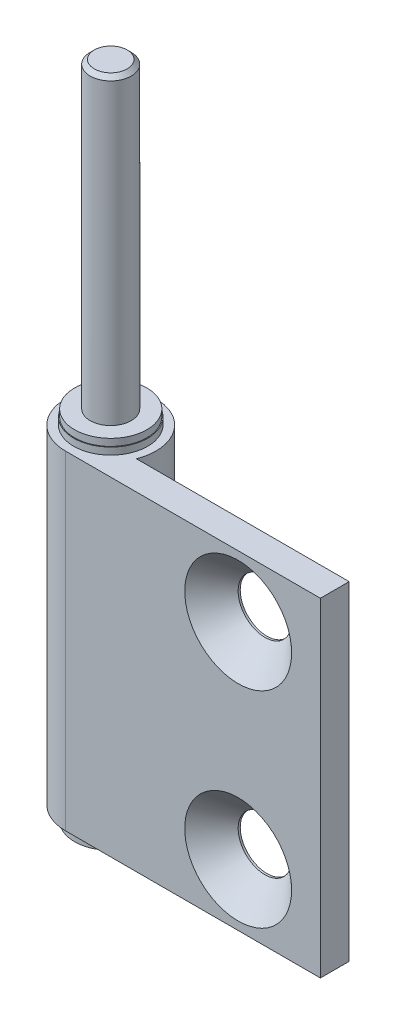
ISO-10303-21;
HEADER;
FILE_DESCRIPTION(('STEP AP214'),'2;1');
FILE_NAME('part.step','',(''),(''),'','','');
FILE_SCHEMA(('AUTOMOTIVE_DESIGN { 1 0 10303 214 1 1 1 1 }'));
ENDSEC;
DATA;
#1=APPLICATION_CONTEXT('core data for automotive mechanical design processes');
#2=APPLICATION_PROTOCOL_DEFINITION('international standard','automotive_design',2000,#1);
#3=PRODUCT_CONTEXT('',#1,'mechanical');
#4=PRODUCT('Part','Part','',(#3));
#5=PRODUCT_RELATED_PRODUCT_CATEGORY('part','',(#4));
#6=PRODUCT_DEFINITION_FORMATION('','',#4);
#7=PRODUCT_DEFINITION_CONTEXT('part definition',#1,'design');
#8=PRODUCT_DEFINITION('design','',#6,#7);
#9=PRODUCT_DEFINITION_SHAPE('','',#8);
#10=(LENGTH_UNIT() NAMED_UNIT(*) SI_UNIT(.MILLI.,.METRE.));
#11=(NAMED_UNIT(*) PLANE_ANGLE_UNIT() SI_UNIT($,.RADIAN.));
#12=(NAMED_UNIT(*) SI_UNIT($,.STERADIAN.) SOLID_ANGLE_UNIT());
#13=UNCERTAINTY_MEASURE_WITH_UNIT(LENGTH_MEASURE(1.E-05),#10,'distance_accuracy_value','');
#14=(GEOMETRIC_REPRESENTATION_CONTEXT(3) GLOBAL_UNCERTAINTY_ASSIGNED_CONTEXT((#13)) GLOBAL_UNIT_ASSIGNED_CONTEXT((#10,
#11,#12)) REPRESENTATION_CONTEXT('',''));
#15=CARTESIAN_POINT('',(0.,0.,0.));
#16=DIRECTION('',(0.,0.,1.));
#17=DIRECTION('',(1.,0.,0.));
#18=AXIS2_PLACEMENT_3D('',#15,#16,#17);
#19=CARTESIAN_POINT('',(31.,-1.7,2.));
#20=DIRECTION('',(1.,0.,0.));
#21=DIRECTION('',(0.,0.,-1.));
#22=AXIS2_PLACEMENT_3D('',#19,#20,#21);
#23=PLANE('',#22);
#24=DIRECTION('',(0.,0.,1.));
#25=VECTOR('',#24,1.);
#26=CARTESIAN_POINT('',(31.,-41.7,2.));
#27=LINE('',#26,#25);
#28=CARTESIAN_POINT('',(31.,-41.7,2.));
#29=VERTEX_POINT('',#28);
#30=CARTESIAN_POINT('',(31.,-41.7,5.5));
#31=VERTEX_POINT('',#30);
#32=EDGE_CURVE('E104',#29,#31,#27,.T.);
#33=ORIENTED_EDGE('',*,*,#32,.F.);
#34=DIRECTION('',(0.,-1.,0.));
#35=VECTOR('',#34,1.);
#36=CARTESIAN_POINT('',(31.,-1.7,2.));
#37=LINE('',#36,#35);
#38=CARTESIAN_POINT('',(31.,-1.7,2.));
#39=VERTEX_POINT('',#38);
#40=EDGE_CURVE('E52',#39,#29,#37,.T.);
#41=ORIENTED_EDGE('',*,*,#40,.F.);
#42=DIRECTION('',(0.,0.,1.));
#43=VECTOR('',#42,1.);
#44=CARTESIAN_POINT('',(31.,-1.7,2.));
#45=LINE('',#44,#43);
#46=CARTESIAN_POINT('',(31.,-1.7,5.5));
#47=VERTEX_POINT('',#46);
#48=EDGE_CURVE('E97',#39,#47,#45,.T.);
#49=ORIENTED_EDGE('',*,*,#48,.T.);
#50=DIRECTION('',(0.,-1.,0.));
#51=VECTOR('',#50,1.);
#52=CARTESIAN_POINT('',(31.,-1.7,5.5));
#53=LINE('',#52,#51);
#54=EDGE_CURVE('E80',#47,#31,#53,.T.);
#55=ORIENTED_EDGE('',*,*,#54,.T.);
#56=EDGE_LOOP('',(#33,#41,#49,#55));
#57=FACE_BOUND('',#56,.T.);
#58=ADVANCED_FACE('F35',(#57),#23,.T.);
#59=CARTESIAN_POINT('',(5.1234753829798,-1.7,2.));
#60=DIRECTION('',(0.,0.,-1.));
#61=DIRECTION('',(-1.,0.,0.));
#62=AXIS2_PLACEMENT_3D('',#59,#60,#61);
#63=PLANE('',#62);
#64=CARTESIAN_POINT('',(21.,-34.2,2.));
#65=DIRECTION('',(0.,0.,-1.));
#66=DIRECTION('',(-1.,0.,0.));
#67=AXIS2_PLACEMENT_3D('',#64,#65,#66);
#68=CIRCLE('',#67,3.25000000003527);
#69=CARTESIAN_POINT('',(17.7499999999647,-34.2,2.));
#70=VERTEX_POINT('',#69);
#71=EDGE_CURVE('E125',#70,#70,#68,.T.);
#72=ORIENTED_EDGE('',*,*,#71,.F.);
#73=EDGE_LOOP('',(#72));
#74=FACE_BOUND('',#73,.T.);
#75=CARTESIAN_POINT('',(21.,-9.2,2.));
#76=DIRECTION('',(0.,0.,-1.));
#77=DIRECTION('',(-1.,0.,0.));
#78=AXIS2_PLACEMENT_3D('',#75,#76,#77);
#79=CIRCLE('',#78,3.25000000003527);
#80=CARTESIAN_POINT('',(17.7499999999647,-9.2,2.));
#81=VERTEX_POINT('',#80);
#82=EDGE_CURVE('E120',#81,#81,#79,.T.);
#83=ORIENTED_EDGE('',*,*,#82,.F.);
#84=EDGE_LOOP('',(#83));
#85=FACE_BOUND('',#84,.T.);
#86=DIRECTION('',(1.,0.,0.));
#87=VECTOR('',#86,1.);
#88=CARTESIAN_POINT('',(5.1234753829798,-41.7,2.));
#89=LINE('',#88,#87);
#90=CARTESIAN_POINT('',(5.1234753829798,-41.7,2.));
#91=VERTEX_POINT('',#90);
#92=EDGE_CURVE('E99',#91,#29,#89,.T.);
#93=ORIENTED_EDGE('',*,*,#92,.F.);
#94=DIRECTION('',(0.,-1.,0.));
#95=VECTOR('',#94,1.);
#96=CARTESIAN_POINT('',(5.1234753829798,-1.7,2.));
#97=LINE('',#96,#95);
#98=CARTESIAN_POINT('',(5.1234753829798,-1.7,2.));
#99=VERTEX_POINT('',#98);
#100=EDGE_CURVE('E69',#99,#91,#97,.T.);
#101=ORIENTED_EDGE('',*,*,#100,.F.);
#102=DIRECTION('',(1.,0.,0.));
#103=VECTOR('',#102,1.);
#104=CARTESIAN_POINT('',(5.1234753829798,-1.7,2.));
#105=LINE('',#104,#103);
#106=EDGE_CURVE('E94',#99,#39,#105,.T.);
#107=ORIENTED_EDGE('',*,*,#106,.T.);
#108=ORIENTED_EDGE('',*,*,#40,.T.);
#109=EDGE_LOOP('',(#93,#101,#107,#108));
#110=FACE_BOUND('',#109,.T.);
#111=ADVANCED_FACE('F149',(#74,#85,#110),#63,.T.);
#112=CARTESIAN_POINT('',(0.,-1.7,0.));
#113=DIRECTION('',(0.,-1.,0.));
#114=DIRECTION('',(0.,0.,-1.));
#115=AXIS2_PLACEMENT_3D('',#112,#113,#114);
#116=CYLINDRICAL_SURFACE('',#115,5.5);
#117=CARTESIAN_POINT('',(0.,-41.7,0.));
#118=DIRECTION('',(0.,-1.,0.));
#119=DIRECTION('',(0.,0.,-1.));
#120=AXIS2_PLACEMENT_3D('',#117,#118,#119);
#121=CIRCLE('',#120,5.5);
#122=CARTESIAN_POINT('',(0.,-41.7,5.5));
#123=VERTEX_POINT('',#122);
#124=EDGE_CURVE('E88',#123,#91,#121,.T.);
#125=ORIENTED_EDGE('',*,*,#124,.F.);
#126=DIRECTION('',(0.,-1.,0.));
#127=VECTOR('',#126,1.);
#128=CARTESIAN_POINT('',(0.,-1.7,5.5));
#129=LINE('',#128,#127);
#130=CARTESIAN_POINT('',(0.,-1.7,5.5));
#131=VERTEX_POINT('',#130);
#132=EDGE_CURVE('E83',#131,#123,#129,.T.);
#133=ORIENTED_EDGE('',*,*,#132,.F.);
#134=CARTESIAN_POINT('',(0.,-1.7,0.));
#135=DIRECTION('',(0.,-1.,0.));
#136=DIRECTION('',(0.,0.,-1.));
#137=AXIS2_PLACEMENT_3D('',#134,#135,#136);
#138=CIRCLE('',#137,5.5);
#139=EDGE_CURVE('E86',#131,#99,#138,.T.);
#140=ORIENTED_EDGE('',*,*,#139,.T.);
#141=ORIENTED_EDGE('',*,*,#100,.T.);
#142=EDGE_LOOP('',(#125,#133,#140,#141));
#143=FACE_BOUND('',#142,.T.);
#144=ADVANCED_FACE('F85',(#143),#116,.T.);
#145=CARTESIAN_POINT('',(31.,-1.7,5.5));
#146=DIRECTION('',(0.,0.,1.));
#147=DIRECTION('',(1.,0.,0.));
#148=AXIS2_PLACEMENT_3D('',#145,#146,#147);
#149=PLANE('',#148);
#150=CARTESIAN_POINT('',(21.,-34.2,5.5));
#151=DIRECTION('',(0.,0.,1.));
#152=DIRECTION('',(1.,0.,0.));
#153=AXIS2_PLACEMENT_3D('',#150,#151,#152);
#154=CIRCLE('',#153,6.49999999995844);
#155=CARTESIAN_POINT('',(27.4999999999584,-34.2,5.5));
#156=VERTEX_POINT('',#155);
#157=EDGE_CURVE('E236',#156,#156,#154,.T.);
#158=ORIENTED_EDGE('',*,*,#157,.F.);
#159=EDGE_LOOP('',(#158));
#160=FACE_BOUND('',#159,.T.);
#161=CARTESIAN_POINT('',(21.,-9.2,5.5));
#162=DIRECTION('',(0.,0.,1.));
#163=DIRECTION('',(1.,0.,0.));
#164=AXIS2_PLACEMENT_3D('',#161,#162,#163);
#165=CIRCLE('',#164,6.49999999995844);
#166=CARTESIAN_POINT('',(27.4999999999584,-9.2,5.5));
#167=VERTEX_POINT('',#166);
#168=EDGE_CURVE('E128',#167,#167,#165,.T.);
#169=ORIENTED_EDGE('',*,*,#168,.F.);
#170=EDGE_LOOP('',(#169));
#171=FACE_BOUND('',#170,.T.);
#172=DIRECTION('',(-1.,0.,0.));
#173=VECTOR('',#172,1.);
#174=CARTESIAN_POINT('',(31.,-41.7,5.5));
#175=LINE('',#174,#173);
#176=EDGE_CURVE('E107',#31,#123,#175,.T.);
#177=ORIENTED_EDGE('',*,*,#176,.F.);
#178=ORIENTED_EDGE('',*,*,#54,.F.);
#179=DIRECTION('',(-1.,0.,0.));
#180=VECTOR('',#179,1.);
#181=CARTESIAN_POINT('',(31.,-1.7,5.5));
#182=LINE('',#181,#180);
#183=EDGE_CURVE('E93',#47,#131,#182,.T.);
#184=ORIENTED_EDGE('',*,*,#183,.T.);
#185=ORIENTED_EDGE('',*,*,#132,.T.);
#186=EDGE_LOOP('',(#177,#178,#184,#185));
#187=FACE_BOUND('',#186,.T.);
#188=ADVANCED_FACE('F96',(#160,#171,#187),#149,.T.);
#189=CARTESIAN_POINT('',(0.,-1.7,0.));
#190=DIRECTION('',(0.,-1.,0.));
#191=DIRECTION('',(0.,0.,-1.));
#192=AXIS2_PLACEMENT_3D('',#189,#190,#191);
#193=PLANE('',#192);
#194=CARTESIAN_POINT('',(0.,-1.7,0.));
#195=DIRECTION('',(0.,-1.,0.));
#196=DIRECTION('',(0.,0.,-1.));
#197=AXIS2_PLACEMENT_3D('',#194,#195,#196);
#198=CIRCLE('',#197,4.5);
#199=CARTESIAN_POINT('',(0.,-1.7,-4.5));
#200=VERTEX_POINT('',#199);
#201=EDGE_CURVE('E108',#200,#200,#198,.T.);
#202=ORIENTED_EDGE('',*,*,#201,.T.);
#203=EDGE_LOOP('',(#202));
#204=FACE_BOUND('',#203,.T.);
#205=ORIENTED_EDGE('',*,*,#48,.F.);
#206=ORIENTED_EDGE('',*,*,#106,.F.);
#207=ORIENTED_EDGE('',*,*,#139,.F.);
#208=ORIENTED_EDGE('',*,*,#183,.F.);
#209=EDGE_LOOP('',(#205,#206,#207,#208));
#210=FACE_BOUND('',#209,.T.);
#211=ADVANCED_FACE('F92',(#204,#210),#193,.F.);
#212=CARTESIAN_POINT('',(0.,-41.7,0.));
#213=DIRECTION('',(0.,-1.,0.));
#214=DIRECTION('',(0.,0.,-1.));
#215=AXIS2_PLACEMENT_3D('',#212,#213,#214);
#216=PLANE('',#215);
#217=CARTESIAN_POINT('',(0.,-41.7,0.));
#218=DIRECTION('',(0.,-1.,0.));
#219=DIRECTION('',(0.,0.,-1.));
#220=AXIS2_PLACEMENT_3D('',#217,#218,#219);
#221=CIRCLE('',#220,4.5);
#222=CARTESIAN_POINT('',(0.,-41.7,-4.5));
#223=VERTEX_POINT('',#222);
#224=EDGE_CURVE('E114',#223,#223,#221,.T.);
#225=ORIENTED_EDGE('',*,*,#224,.F.);
#226=EDGE_LOOP('',(#225));
#227=FACE_BOUND('',#226,.T.);
#228=ORIENTED_EDGE('',*,*,#32,.T.);
#229=ORIENTED_EDGE('',*,*,#176,.T.);
#230=ORIENTED_EDGE('',*,*,#124,.T.);
#231=ORIENTED_EDGE('',*,*,#92,.T.);
#232=EDGE_LOOP('',(#228,#229,#230,#231));
#233=FACE_BOUND('',#232,.T.);
#234=ADVANCED_FACE('F162',(#227,#233),#216,.T.);
#235=CARTESIAN_POINT('',(0.,36.8,0.));
#236=DIRECTION('',(0.,-1.,0.));
#237=DIRECTION('',(0.,0.,-1.));
#238=AXIS2_PLACEMENT_3D('',#235,#236,#237);
#239=CYLINDRICAL_SURFACE('',#238,2.5);
#240=CARTESIAN_POINT('',(0.,36.2999999999558,0.));
#241=DIRECTION('',(0.,1.,0.));
#242=DIRECTION('',(0.,0.,1.));
#243=AXIS2_PLACEMENT_3D('',#240,#241,#242);
#244=CIRCLE('',#243,2.5);
#245=CARTESIAN_POINT('',(0.,36.2999999999558,2.5));
#246=VERTEX_POINT('',#245);
#247=EDGE_CURVE('E119',#246,#246,#244,.F.);
#248=ORIENTED_EDGE('',*,*,#247,.T.);
#249=EDGE_LOOP('',(#248));
#250=FACE_BOUND('',#249,.T.);
#251=CARTESIAN_POINT('',(0.,0.,0.));
#252=DIRECTION('',(0.,-1.,0.));
#253=DIRECTION('',(0.,0.,-1.));
#254=AXIS2_PLACEMENT_3D('',#251,#252,#253);
#255=CIRCLE('',#254,2.5);
#256=CARTESIAN_POINT('',(0.,0.,-2.5));
#257=VERTEX_POINT('',#256);
#258=EDGE_CURVE('E255',#257,#257,#255,.T.);
#259=ORIENTED_EDGE('',*,*,#258,.F.);
#260=EDGE_LOOP('',(#259));
#261=FACE_BOUND('',#260,.T.);
#262=ADVANCED_FACE('F165',(#250,#261),#239,.T.);
#263=CARTESIAN_POINT('',(2.5,36.8,0.));
#264=DIRECTION('',(0.,1.,0.));
#265=DIRECTION('',(0.,0.,1.));
#266=AXIS2_PLACEMENT_3D('',#263,#264,#265);
#267=PLANE('',#266);
#268=CARTESIAN_POINT('',(0.,36.8,0.));
#269=DIRECTION('',(0.,1.,0.));
#270=DIRECTION('',(0.,0.,1.));
#271=AXIS2_PLACEMENT_3D('',#268,#269,#270);
#272=CIRCLE('',#271,1.99999999995584);
#273=CARTESIAN_POINT('',(0.,36.8,1.99999999995584));
#274=VERTEX_POINT('',#273);
#275=EDGE_CURVE('E132',#274,#274,#272,.T.);
#276=ORIENTED_EDGE('',*,*,#275,.T.);
#277=EDGE_LOOP('',(#276));
#278=FACE_BOUND('',#277,.T.);
#279=ADVANCED_FACE('F172',(#278),#267,.T.);
#280=CARTESIAN_POINT('',(0.,36.8,0.));
#281=DIRECTION('',(0.,-1.,0.));
#282=DIRECTION('',(0.,0.,-1.));
#283=AXIS2_PLACEMENT_3D('',#280,#281,#282);
#284=CYLINDRICAL_SURFACE('',#283,4.5);
#285=CARTESIAN_POINT('',(0.,-0.850000000000004,0.));
#286=DIRECTION('',(0.,-1.,0.));
#287=DIRECTION('',(0.,0.,-1.));
#288=AXIS2_PLACEMENT_3D('',#285,#286,#287);
#289=CIRCLE('',#288,4.5);
#290=CARTESIAN_POINT('',(0.,-0.850000000000004,-4.5));
#291=VERTEX_POINT('',#290);
#292=EDGE_CURVE('E264',#291,#291,#289,.T.);
#293=ORIENTED_EDGE('',*,*,#292,.T.);
#294=EDGE_LOOP('',(#293));
#295=FACE_BOUND('',#294,.T.);
#296=ORIENTED_EDGE('',*,*,#201,.F.);
#297=EDGE_LOOP('',(#296));
#298=FACE_BOUND('',#297,.T.);
#299=ADVANCED_FACE('F176',(#295,#298),#284,.T.);
#300=CARTESIAN_POINT('',(4.5,-0.850000000000004,0.));
#301=DIRECTION('',(0.,1.,0.));
#302=DIRECTION('',(0.,0.,1.));
#303=AXIS2_PLACEMENT_3D('',#300,#301,#302);
#304=PLANE('',#303);
#305=CARTESIAN_POINT('',(0.,-0.850000000000004,0.));
#306=DIRECTION('',(0.,-1.,0.));
#307=DIRECTION('',(0.,0.,-1.));
#308=AXIS2_PLACEMENT_3D('',#305,#306,#307);
#309=CIRCLE('',#308,4.4);
#310=CARTESIAN_POINT('',(0.,-0.850000000000004,-4.4));
#311=VERTEX_POINT('',#310);
#312=EDGE_CURVE('E261',#311,#311,#309,.T.);
#313=ORIENTED_EDGE('',*,*,#312,.T.);
#314=EDGE_LOOP('',(#313));
#315=FACE_BOUND('',#314,.T.);
#316=ORIENTED_EDGE('',*,*,#292,.F.);
#317=EDGE_LOOP('',(#316));
#318=FACE_BOUND('',#317,.T.);
#319=ADVANCED_FACE('F180',(#315,#318),#304,.T.);
#320=CARTESIAN_POINT('',(0.,36.8,0.));
#321=DIRECTION('',(0.,-1.,0.));
#322=DIRECTION('',(0.,0.,-1.));
#323=AXIS2_PLACEMENT_3D('',#320,#321,#322);
#324=CYLINDRICAL_SURFACE('',#323,4.4);
#325=CARTESIAN_POINT('',(0.,0.,0.));
#326=DIRECTION('',(0.,-1.,0.));
#327=DIRECTION('',(0.,0.,-1.));
#328=AXIS2_PLACEMENT_3D('',#325,#326,#327);
#329=CIRCLE('',#328,4.4);
#330=CARTESIAN_POINT('',(0.,0.,-4.4));
#331=VERTEX_POINT('',#330);
#332=EDGE_CURVE('E258',#331,#331,#329,.T.);
#333=ORIENTED_EDGE('',*,*,#332,.T.);
#334=EDGE_LOOP('',(#333));
#335=FACE_BOUND('',#334,.T.);
#336=ORIENTED_EDGE('',*,*,#312,.F.);
#337=EDGE_LOOP('',(#336));
#338=FACE_BOUND('',#337,.T.);
#339=ADVANCED_FACE('F184',(#335,#338),#324,.T.);
#340=CARTESIAN_POINT('',(4.4,0.,0.));
#341=DIRECTION('',(0.,1.,0.));
#342=DIRECTION('',(0.,0.,1.));
#343=AXIS2_PLACEMENT_3D('',#340,#341,#342);
#344=PLANE('',#343);
#345=ORIENTED_EDGE('',*,*,#258,.T.);
#346=EDGE_LOOP('',(#345));
#347=FACE_BOUND('',#346,.T.);
#348=ORIENTED_EDGE('',*,*,#332,.F.);
#349=EDGE_LOOP('',(#348));
#350=FACE_BOUND('',#349,.T.);
#351=ADVANCED_FACE('F188',(#347,#350),#344,.T.);
#352=CARTESIAN_POINT('',(0.,-41.7,0.));
#353=DIRECTION('',(0.,-1.,0.));
#354=DIRECTION('',(0.,0.,-1.));
#355=AXIS2_PLACEMENT_3D('',#352,#353,#354);
#356=CYLINDRICAL_SURFACE('',#355,4.5);
#357=ORIENTED_EDGE('',*,*,#224,.T.);
#358=EDGE_LOOP('',(#357));
#359=FACE_BOUND('',#358,.T.);
#360=CARTESIAN_POINT('',(0.,-42.55,0.));
#361=DIRECTION('',(0.,-1.,0.));
#362=DIRECTION('',(0.,0.,-1.));
#363=AXIS2_PLACEMENT_3D('',#360,#361,#362);
#364=CIRCLE('',#363,4.5);
#365=CARTESIAN_POINT('',(0.,-42.55,-4.5));
#366=VERTEX_POINT('',#365);
#367=EDGE_CURVE('E123',#366,#366,#364,.T.);
#368=ORIENTED_EDGE('',*,*,#367,.F.);
#369=EDGE_LOOP('',(#368));
#370=FACE_BOUND('',#369,.T.);
#371=ADVANCED_FACE('F192',(#359,#370),#356,.T.);
#372=CARTESIAN_POINT('',(0.,-44.9,0.));
#373=DIRECTION('',(0.,-1.,0.));
#374=DIRECTION('',(0.,0.,-1.));
#375=AXIS2_PLACEMENT_3D('',#372,#373,#374);
#376=PLANE('',#375);
#377=CARTESIAN_POINT('',(0.,-44.9,0.));
#378=DIRECTION('',(0.,-1.,0.));
#379=DIRECTION('',(0.,0.,-1.));
#380=AXIS2_PLACEMENT_3D('',#377,#378,#379);
#381=CIRCLE('',#380,1.99999999995584);
#382=CARTESIAN_POINT('',(0.,-44.9,-1.99999999995584));
#383=VERTEX_POINT('',#382);
#384=EDGE_CURVE('E44',#383,#383,#381,.T.);
#385=ORIENTED_EDGE('',*,*,#384,.T.);
#386=EDGE_LOOP('',(#385));
#387=FACE_BOUND('',#386,.T.);
#388=ADVANCED_FACE('F137',(#387),#376,.T.);
#389=CARTESIAN_POINT('',(0.,-41.7,0.));
#390=DIRECTION('',(0.,-1.,0.));
#391=DIRECTION('',(0.,0.,-1.));
#392=AXIS2_PLACEMENT_3D('',#389,#390,#391);
#393=CYLINDRICAL_SURFACE('',#392,2.5);
#394=CARTESIAN_POINT('',(0.,-44.3999999999559,0.));
#395=DIRECTION('',(0.,-1.,0.));
#396=DIRECTION('',(0.,0.,-1.));
#397=AXIS2_PLACEMENT_3D('',#394,#395,#396);
#398=CIRCLE('',#397,2.5);
#399=CARTESIAN_POINT('',(0.,-44.3999999999559,-2.5));
#400=VERTEX_POINT('',#399);
#401=EDGE_CURVE('E11',#400,#400,#398,.F.);
#402=ORIENTED_EDGE('',*,*,#401,.T.);
#403=EDGE_LOOP('',(#402));
#404=FACE_BOUND('',#403,.T.);
#405=CARTESIAN_POINT('',(0.,-43.4,0.));
#406=DIRECTION('',(0.,-1.,0.));
#407=DIRECTION('',(0.,0.,-1.));
#408=AXIS2_PLACEMENT_3D('',#405,#406,#407);
#409=CIRCLE('',#408,2.5);
#410=CARTESIAN_POINT('',(0.,-43.4,-2.5));
#411=VERTEX_POINT('',#410);
#412=EDGE_CURVE('E252',#411,#411,#409,.T.);
#413=ORIENTED_EDGE('',*,*,#412,.T.);
#414=EDGE_LOOP('',(#413));
#415=FACE_BOUND('',#414,.T.);
#416=ADVANCED_FACE('F199',(#404,#415),#393,.T.);
#417=CARTESIAN_POINT('',(2.5,-43.4,0.));
#418=DIRECTION('',(0.,-1.,0.));
#419=DIRECTION('',(0.,0.,-1.));
#420=AXIS2_PLACEMENT_3D('',#417,#418,#419);
#421=PLANE('',#420);
#422=CARTESIAN_POINT('',(0.,-43.4,0.));
#423=DIRECTION('',(0.,-1.,0.));
#424=DIRECTION('',(0.,0.,-1.));
#425=AXIS2_PLACEMENT_3D('',#422,#423,#424);
#426=CIRCLE('',#425,4.4);
#427=CARTESIAN_POINT('',(0.,-43.4,-4.4));
#428=VERTEX_POINT('',#427);
#429=EDGE_CURVE('E249',#428,#428,#426,.T.);
#430=ORIENTED_EDGE('',*,*,#429,.T.);
#431=EDGE_LOOP('',(#430));
#432=FACE_BOUND('',#431,.T.);
#433=ORIENTED_EDGE('',*,*,#412,.F.);
#434=EDGE_LOOP('',(#433));
#435=FACE_BOUND('',#434,.T.);
#436=ADVANCED_FACE('F202',(#432,#435),#421,.T.);
#437=CARTESIAN_POINT('',(0.,-41.7,0.));
#438=DIRECTION('',(0.,-1.,0.));
#439=DIRECTION('',(0.,0.,-1.));
#440=AXIS2_PLACEMENT_3D('',#437,#438,#439);
#441=CYLINDRICAL_SURFACE('',#440,4.4);
#442=CARTESIAN_POINT('',(0.,-42.55,0.));
#443=DIRECTION('',(0.,-1.,0.));
#444=DIRECTION('',(0.,0.,-1.));
#445=AXIS2_PLACEMENT_3D('',#442,#443,#444);
#446=CIRCLE('',#445,4.4);
#447=CARTESIAN_POINT('',(0.,-42.55,-4.4));
#448=VERTEX_POINT('',#447);
#449=EDGE_CURVE('E246',#448,#448,#446,.T.);
#450=ORIENTED_EDGE('',*,*,#449,.T.);
#451=EDGE_LOOP('',(#450));
#452=FACE_BOUND('',#451,.T.);
#453=ORIENTED_EDGE('',*,*,#429,.F.);
#454=EDGE_LOOP('',(#453));
#455=FACE_BOUND('',#454,.T.);
#456=ADVANCED_FACE('F206',(#452,#455),#441,.T.);
#457=CARTESIAN_POINT('',(4.4,-42.55,0.));
#458=DIRECTION('',(0.,-1.,0.));
#459=DIRECTION('',(0.,0.,-1.));
#460=AXIS2_PLACEMENT_3D('',#457,#458,#459);
#461=PLANE('',#460);
#462=ORIENTED_EDGE('',*,*,#367,.T.);
#463=EDGE_LOOP('',(#462));
#464=FACE_BOUND('',#463,.T.);
#465=ORIENTED_EDGE('',*,*,#449,.F.);
#466=EDGE_LOOP('',(#465));
#467=FACE_BOUND('',#466,.T.);
#468=ADVANCED_FACE('F210',(#464,#467),#461,.T.);
#469=CARTESIAN_POINT('',(21.,-9.2,5.5));
#470=DIRECTION('',(0.,0.,1.));
#471=DIRECTION('',(1.,0.,0.));
#472=AXIS2_PLACEMENT_3D('',#469,#470,#471);
#473=CYLINDRICAL_SURFACE('',#472,3.25000000003527);
#474=ORIENTED_EDGE('',*,*,#82,.T.);
#475=EDGE_LOOP('',(#474));
#476=FACE_BOUND('',#475,.T.);
#477=CARTESIAN_POINT('',(21.,-9.2,2.25000000007685));
#478=DIRECTION('',(0.,0.,1.));
#479=DIRECTION('',(1.,0.,0.));
#480=AXIS2_PLACEMENT_3D('',#477,#478,#479);
#481=CIRCLE('',#480,3.25000000003528);
#482=CARTESIAN_POINT('',(24.2500000000353,-9.2,2.25000000007685));
#483=VERTEX_POINT('',#482);
#484=EDGE_CURVE('E124',#483,#483,#481,.T.);
#485=ORIENTED_EDGE('',*,*,#484,.T.);
#486=EDGE_LOOP('',(#485));
#487=FACE_BOUND('',#486,.T.);
#488=ADVANCED_FACE('F214',(#476,#487),#473,.F.);
#489=CARTESIAN_POINT('',(21.,-9.2,5.5));
#490=DIRECTION('',(0.,0.,1.));
#491=DIRECTION('',(1.,0.,0.));
#492=AXIS2_PLACEMENT_3D('',#489,#490,#491);
#493=CONICAL_SURFACE('',#492,6.49999999995844,0.78539816339745);
#494=ORIENTED_EDGE('',*,*,#484,.F.);
#495=EDGE_LOOP('',(#494));
#496=FACE_BOUND('',#495,.T.);
#497=ORIENTED_EDGE('',*,*,#168,.T.);
#498=EDGE_LOOP('',(#497));
#499=FACE_BOUND('',#498,.T.);
#500=ADVANCED_FACE('F218',(#496,#499),#493,.F.);
#501=CARTESIAN_POINT('',(21.,-34.2,5.5));
#502=DIRECTION('',(0.,0.,1.));
#503=DIRECTION('',(1.,0.,0.));
#504=AXIS2_PLACEMENT_3D('',#501,#502,#503);
#505=CYLINDRICAL_SURFACE('',#504,3.25000000003527);
#506=ORIENTED_EDGE('',*,*,#71,.T.);
#507=EDGE_LOOP('',(#506));
#508=FACE_BOUND('',#507,.T.);
#509=CARTESIAN_POINT('',(21.,-34.2,2.25000000007685));
#510=DIRECTION('',(0.,0.,1.));
#511=DIRECTION('',(1.,0.,0.));
#512=AXIS2_PLACEMENT_3D('',#509,#510,#511);
#513=CIRCLE('',#512,3.25000000003528);
#514=CARTESIAN_POINT('',(24.2500000000353,-34.2,2.25000000007685));
#515=VERTEX_POINT('',#514);
#516=EDGE_CURVE('E129',#515,#515,#513,.T.);
#517=ORIENTED_EDGE('',*,*,#516,.T.);
#518=EDGE_LOOP('',(#517));
#519=FACE_BOUND('',#518,.T.);
#520=ADVANCED_FACE('F222',(#508,#519),#505,.F.);
#521=CARTESIAN_POINT('',(21.,-34.2,5.5));
#522=DIRECTION('',(0.,0.,1.));
#523=DIRECTION('',(1.,0.,0.));
#524=AXIS2_PLACEMENT_3D('',#521,#522,#523);
#525=CONICAL_SURFACE('',#524,6.49999999995844,0.78539816339745);
#526=ORIENTED_EDGE('',*,*,#516,.F.);
#527=EDGE_LOOP('',(#526));
#528=FACE_BOUND('',#527,.T.);
#529=ORIENTED_EDGE('',*,*,#157,.T.);
#530=EDGE_LOOP('',(#529));
#531=FACE_BOUND('',#530,.T.);
#532=ADVANCED_FACE('F145',(#528,#531),#525,.F.);
#533=CARTESIAN_POINT('',(0.,36.2999999999558,0.));
#534=DIRECTION('',(0.,-1.,0.));
#535=DIRECTION('',(0.,0.,-1.));
#536=AXIS2_PLACEMENT_3D('',#533,#534,#535);
#537=CONICAL_SURFACE('',#536,2.5,0.785398163397446);
#538=ORIENTED_EDGE('',*,*,#275,.F.);
#539=EDGE_LOOP('',(#538));
#540=FACE_BOUND('',#539,.T.);
#541=ORIENTED_EDGE('',*,*,#247,.F.);
#542=EDGE_LOOP('',(#541));
#543=FACE_BOUND('',#542,.T.);
#544=ADVANCED_FACE('F140',(#540,#543),#537,.T.);
#545=CARTESIAN_POINT('',(0.,-44.9,0.));
#546=DIRECTION('',(0.,1.,0.));
#547=DIRECTION('',(0.,0.,1.));
#548=AXIS2_PLACEMENT_3D('',#545,#546,#547);
#549=CONICAL_SURFACE('',#548,1.99999999995584,0.78539816339746);
#550=ORIENTED_EDGE('',*,*,#401,.F.);
#551=EDGE_LOOP('',(#550));
#552=FACE_BOUND('',#551,.T.);
#553=ORIENTED_EDGE('',*,*,#384,.F.);
#554=EDGE_LOOP('',(#553));
#555=FACE_BOUND('',#554,.T.);
#556=ADVANCED_FACE('F37',(#552,#555),#549,.T.);
#557=CLOSED_SHELL('',(#58,#111,#144,#188,#211,#234,#262,#279,#299,#319,#339,#351,#371,#388,#416,
#436,#456,#468,#488,#500,#520,#532,#544,#556));
#558=MANIFOLD_SOLID_BREP('B2',#557);
#559=ADVANCED_BREP_SHAPE_REPRESENTATION('',(#18,#558),#14);
#560=SHAPE_DEFINITION_REPRESENTATION(#9,#559);
ENDSEC;
END-ISO-10303-21;
